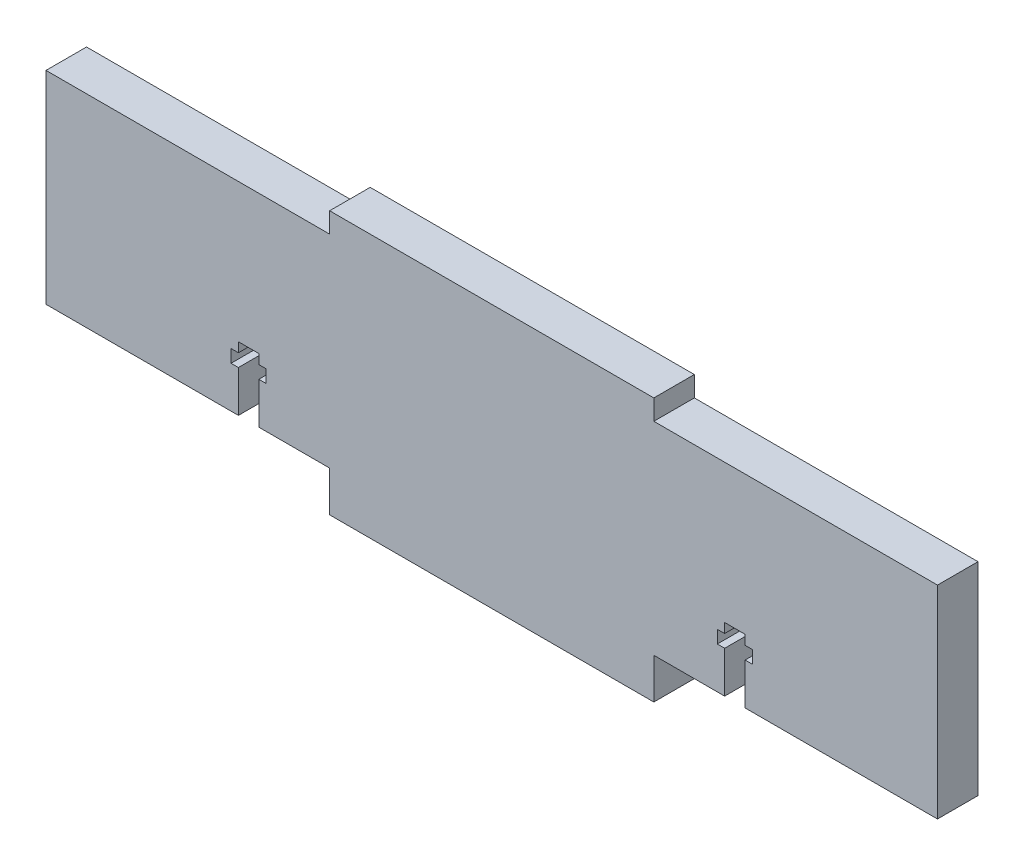
ISO-10303-21;
HEADER;
FILE_DESCRIPTION(('STEP AP214'),'2;1');
FILE_NAME('part.step','',(''),(''),'','','');
FILE_SCHEMA(('AUTOMOTIVE_DESIGN { 1 0 10303 214 1 1 1 1 }'));
ENDSEC;
DATA;
#1=APPLICATION_CONTEXT('core data for automotive mechanical design processes');
#2=APPLICATION_PROTOCOL_DEFINITION('international standard','automotive_design',2000,#1);
#3=PRODUCT_CONTEXT('',#1,'mechanical');
#4=PRODUCT('Part','Part','',(#3));
#5=PRODUCT_RELATED_PRODUCT_CATEGORY('part','',(#4));
#6=PRODUCT_DEFINITION_FORMATION('','',#4);
#7=PRODUCT_DEFINITION_CONTEXT('part definition',#1,'design');
#8=PRODUCT_DEFINITION('design','',#6,#7);
#9=PRODUCT_DEFINITION_SHAPE('','',#8);
#10=(LENGTH_UNIT() NAMED_UNIT(*) SI_UNIT(.MILLI.,.METRE.));
#11=(NAMED_UNIT(*) PLANE_ANGLE_UNIT() SI_UNIT($,.RADIAN.));
#12=(NAMED_UNIT(*) SI_UNIT($,.STERADIAN.) SOLID_ANGLE_UNIT());
#13=UNCERTAINTY_MEASURE_WITH_UNIT(LENGTH_MEASURE(1.E-05),#10,'distance_accuracy_value','');
#14=(GEOMETRIC_REPRESENTATION_CONTEXT(3) GLOBAL_UNCERTAINTY_ASSIGNED_CONTEXT((#13)) GLOBAL_UNIT_ASSIGNED_CONTEXT((#10,
#11,#12)) REPRESENTATION_CONTEXT('',''));
#15=CARTESIAN_POINT('',(0.,0.,0.));
#16=DIRECTION('',(0.,0.,1.));
#17=DIRECTION('',(1.,0.,0.));
#18=AXIS2_PLACEMENT_3D('',#15,#16,#17);
#19=CARTESIAN_POINT('',(95.25,0.,6.35));
#20=DIRECTION('',(0.,1.,0.));
#21=DIRECTION('',(0.,0.,1.));
#22=AXIS2_PLACEMENT_3D('',#19,#20,#21);
#23=PLANE('',#22);
#24=DIRECTION('',(1.,0.,0.));
#25=VECTOR('',#24,1.);
#26=CARTESIAN_POINT('',(95.25,0.,6.35));
#27=LINE('',#26,#25);
#28=CARTESIAN_POINT('',(109.55,0.,6.35));
#29=VERTEX_POINT('',#28);
#30=CARTESIAN_POINT('',(139.7,0.,6.35));
#31=VERTEX_POINT('',#30);
#32=EDGE_CURVE('E466',#29,#31,#27,.T.);
#33=ORIENTED_EDGE('',*,*,#32,.F.);
#34=DIRECTION('',(0.,0.,1.));
#35=VECTOR('',#34,1.);
#36=CARTESIAN_POINT('',(109.55,0.,0.));
#37=LINE('',#36,#35);
#38=CARTESIAN_POINT('',(109.55,0.,0.));
#39=VERTEX_POINT('',#38);
#40=EDGE_CURVE('E348',#39,#29,#37,.T.);
#41=ORIENTED_EDGE('',*,*,#40,.F.);
#42=DIRECTION('',(1.,0.,0.));
#43=VECTOR('',#42,1.);
#44=CARTESIAN_POINT('',(95.25,0.,0.));
#45=LINE('',#44,#43);
#46=CARTESIAN_POINT('',(139.7,0.,0.));
#47=VERTEX_POINT('',#46);
#48=EDGE_CURVE('E495',#39,#47,#45,.T.);
#49=ORIENTED_EDGE('',*,*,#48,.T.);
#50=DIRECTION('',(0.,0.,-1.));
#51=VECTOR('',#50,1.);
#52=CARTESIAN_POINT('',(139.7,0.,6.35));
#53=LINE('',#52,#51);
#54=EDGE_CURVE('E527',#31,#47,#53,.T.);
#55=ORIENTED_EDGE('',*,*,#54,.F.);
#56=EDGE_LOOP('',(#33,#41,#49,#55));
#57=FACE_BOUND('',#56,.T.);
#58=ADVANCED_FACE('F33',(#57),#23,.F.);
#59=CARTESIAN_POINT('',(0.,0.,6.35));
#60=DIRECTION('',(0.,1.,0.));
#61=DIRECTION('',(0.,0.,1.));
#62=AXIS2_PLACEMENT_3D('',#59,#60,#61);
#63=PLANE('',#62);
#64=DIRECTION('',(1.,0.,0.));
#65=VECTOR('',#64,1.);
#66=CARTESIAN_POINT('',(0.,0.,0.));
#67=LINE('',#66,#65);
#68=CARTESIAN_POINT('',(0.,0.,0.));
#69=VERTEX_POINT('',#68);
#70=CARTESIAN_POINT('',(30.15,0.,0.));
#71=VERTEX_POINT('',#70);
#72=EDGE_CURVE('E486',#69,#71,#67,.T.);
#73=ORIENTED_EDGE('',*,*,#72,.T.);
#74=DIRECTION('',(0.,0.,1.));
#75=VECTOR('',#74,1.);
#76=CARTESIAN_POINT('',(30.15,0.,0.));
#77=LINE('',#76,#75);
#78=CARTESIAN_POINT('',(30.15,0.,6.35));
#79=VERTEX_POINT('',#78);
#80=EDGE_CURVE('E396',#71,#79,#77,.T.);
#81=ORIENTED_EDGE('',*,*,#80,.T.);
#82=DIRECTION('',(1.,0.,0.));
#83=VECTOR('',#82,1.);
#84=CARTESIAN_POINT('',(0.,0.,6.35));
#85=LINE('',#84,#83);
#86=CARTESIAN_POINT('',(0.,0.,6.35));
#87=VERTEX_POINT('',#86);
#88=EDGE_CURVE('E457',#87,#79,#85,.T.);
#89=ORIENTED_EDGE('',*,*,#88,.F.);
#90=DIRECTION('',(0.,0.,-1.));
#91=VECTOR('',#90,1.);
#92=CARTESIAN_POINT('',(0.,0.,6.35));
#93=LINE('',#92,#91);
#94=EDGE_CURVE('E11',#87,#69,#93,.T.);
#95=ORIENTED_EDGE('',*,*,#94,.T.);
#96=EDGE_LOOP('',(#73,#81,#89,#95));
#97=FACE_BOUND('',#96,.T.);
#98=ADVANCED_FACE('F608',(#97),#63,.F.);
#99=CARTESIAN_POINT('',(0.,0.,6.35));
#100=DIRECTION('',(1.,0.,0.));
#101=DIRECTION('',(0.,0.,-1.));
#102=AXIS2_PLACEMENT_3D('',#99,#100,#101);
#103=PLANE('',#102);
#104=DIRECTION('',(0.,-1.,0.));
#105=VECTOR('',#104,1.);
#106=CARTESIAN_POINT('',(0.,0.,0.));
#107=LINE('',#106,#105);
#108=CARTESIAN_POINT('',(0.,31.75,0.));
#109=VERTEX_POINT('',#108);
#110=EDGE_CURVE('E429',#109,#69,#107,.T.);
#111=ORIENTED_EDGE('',*,*,#110,.T.);
#112=ORIENTED_EDGE('',*,*,#94,.F.);
#113=DIRECTION('',(0.,-1.,0.));
#114=VECTOR('',#113,1.);
#115=CARTESIAN_POINT('',(0.,0.,6.35));
#116=LINE('',#115,#114);
#117=CARTESIAN_POINT('',(0.,31.75,6.35));
#118=VERTEX_POINT('',#117);
#119=EDGE_CURVE('E452',#118,#87,#116,.T.);
#120=ORIENTED_EDGE('',*,*,#119,.F.);
#121=DIRECTION('',(0.,0.,-1.));
#122=VECTOR('',#121,1.);
#123=CARTESIAN_POINT('',(0.,31.75,6.35));
#124=LINE('',#123,#122);
#125=EDGE_CURVE('E482',#118,#109,#124,.T.);
#126=ORIENTED_EDGE('',*,*,#125,.T.);
#127=EDGE_LOOP('',(#111,#112,#120,#126));
#128=FACE_BOUND('',#127,.T.);
#129=ADVANCED_FACE('F35',(#128),#103,.F.);
#130=CARTESIAN_POINT('',(33.35,0.,6.35));
#131=VERTEX_POINT('',#130);
#132=CARTESIAN_POINT('',(44.45,0.,6.35));
#133=VERTEX_POINT('',#132);
#134=EDGE_CURVE('E455',#131,#133,#85,.T.);
#135=ORIENTED_EDGE('',*,*,#134,.F.);
#136=DIRECTION('',(0.,0.,1.));
#137=VECTOR('',#136,1.);
#138=CARTESIAN_POINT('',(33.35,0.,0.));
#139=LINE('',#138,#137);
#140=CARTESIAN_POINT('',(33.35,0.,0.));
#141=VERTEX_POINT('',#140);
#142=EDGE_CURVE('E448',#141,#131,#139,.T.);
#143=ORIENTED_EDGE('',*,*,#142,.F.);
#144=CARTESIAN_POINT('',(44.45,0.,0.));
#145=VERTEX_POINT('',#144);
#146=EDGE_CURVE('E485',#141,#145,#67,.T.);
#147=ORIENTED_EDGE('',*,*,#146,.T.);
#148=DIRECTION('',(0.,0.,-1.));
#149=VECTOR('',#148,1.);
#150=CARTESIAN_POINT('',(44.45,0.,6.35));
#151=LINE('',#150,#149);
#152=EDGE_CURVE('E41',#133,#145,#151,.T.);
#153=ORIENTED_EDGE('',*,*,#152,.F.);
#154=EDGE_LOOP('',(#135,#143,#147,#153));
#155=FACE_BOUND('',#154,.T.);
#156=ADVANCED_FACE('F567',(#155),#63,.F.);
#157=CARTESIAN_POINT('',(44.45,0.,6.35));
#158=DIRECTION('',(1.,0.,0.));
#159=DIRECTION('',(0.,1.,0.));
#160=AXIS2_PLACEMENT_3D('',#157,#158,#159);
#161=PLANE('',#160);
#162=DIRECTION('',(0.,-1.,0.));
#163=VECTOR('',#162,1.);
#164=CARTESIAN_POINT('',(44.45,0.,0.));
#165=LINE('',#164,#163);
#166=CARTESIAN_POINT('',(44.45,-6.35,0.));
#167=VERTEX_POINT('',#166);
#168=EDGE_CURVE('E489',#145,#167,#165,.T.);
#169=ORIENTED_EDGE('',*,*,#168,.T.);
#170=DIRECTION('',(0.,0.,-1.));
#171=VECTOR('',#170,1.);
#172=CARTESIAN_POINT('',(44.45,-6.35,6.35));
#173=LINE('',#172,#171);
#174=CARTESIAN_POINT('',(44.45,-6.35,6.35));
#175=VERTEX_POINT('',#174);
#176=EDGE_CURVE('E536',#175,#167,#173,.T.);
#177=ORIENTED_EDGE('',*,*,#176,.F.);
#178=DIRECTION('',(0.,-1.,0.));
#179=VECTOR('',#178,1.);
#180=CARTESIAN_POINT('',(44.45,0.,6.35));
#181=LINE('',#180,#179);
#182=EDGE_CURVE('E460',#133,#175,#181,.T.);
#183=ORIENTED_EDGE('',*,*,#182,.F.);
#184=ORIENTED_EDGE('',*,*,#152,.T.);
#185=EDGE_LOOP('',(#169,#177,#183,#184));
#186=FACE_BOUND('',#185,.T.);
#187=ADVANCED_FACE('F543',(#186),#161,.F.);
#188=CARTESIAN_POINT('',(44.45,-6.35,6.35));
#189=DIRECTION('',(0.,1.,0.));
#190=DIRECTION('',(0.,0.,1.));
#191=AXIS2_PLACEMENT_3D('',#188,#189,#190);
#192=PLANE('',#191);
#193=DIRECTION('',(1.,0.,0.));
#194=VECTOR('',#193,1.);
#195=CARTESIAN_POINT('',(44.45,-6.35,0.));
#196=LINE('',#195,#194);
#197=CARTESIAN_POINT('',(95.25,-6.35,0.));
#198=VERTEX_POINT('',#197);
#199=EDGE_CURVE('E491',#167,#198,#196,.T.);
#200=ORIENTED_EDGE('',*,*,#199,.T.);
#201=DIRECTION('',(0.,0.,-1.));
#202=VECTOR('',#201,1.);
#203=CARTESIAN_POINT('',(95.25,-6.35,6.35));
#204=LINE('',#203,#202);
#205=CARTESIAN_POINT('',(95.25,-6.35,6.35));
#206=VERTEX_POINT('',#205);
#207=EDGE_CURVE('E533',#206,#198,#204,.T.);
#208=ORIENTED_EDGE('',*,*,#207,.F.);
#209=DIRECTION('',(1.,0.,0.));
#210=VECTOR('',#209,1.);
#211=CARTESIAN_POINT('',(44.45,-6.35,6.35));
#212=LINE('',#211,#210);
#213=EDGE_CURVE('E462',#175,#206,#212,.T.);
#214=ORIENTED_EDGE('',*,*,#213,.F.);
#215=ORIENTED_EDGE('',*,*,#176,.T.);
#216=EDGE_LOOP('',(#200,#208,#214,#215));
#217=FACE_BOUND('',#216,.T.);
#218=ADVANCED_FACE('F553',(#217),#192,.F.);
#219=CARTESIAN_POINT('',(95.25,0.,6.35));
#220=DIRECTION('',(-1.,0.,0.));
#221=DIRECTION('',(0.,0.,1.));
#222=AXIS2_PLACEMENT_3D('',#219,#220,#221);
#223=PLANE('',#222);
#224=DIRECTION('',(0.,1.,0.));
#225=VECTOR('',#224,1.);
#226=CARTESIAN_POINT('',(95.25,0.,0.));
#227=LINE('',#226,#225);
#228=CARTESIAN_POINT('',(95.25,0.,0.));
#229=VERTEX_POINT('',#228);
#230=EDGE_CURVE('E493',#198,#229,#227,.T.);
#231=ORIENTED_EDGE('',*,*,#230,.T.);
#232=DIRECTION('',(0.,0.,-1.));
#233=VECTOR('',#232,1.);
#234=CARTESIAN_POINT('',(95.25,0.,6.35));
#235=LINE('',#234,#233);
#236=CARTESIAN_POINT('',(95.25,0.,6.35));
#237=VERTEX_POINT('',#236);
#238=EDGE_CURVE('E530',#237,#229,#235,.T.);
#239=ORIENTED_EDGE('',*,*,#238,.F.);
#240=DIRECTION('',(0.,1.,0.));
#241=VECTOR('',#240,1.);
#242=CARTESIAN_POINT('',(95.25,0.,6.35));
#243=LINE('',#242,#241);
#244=EDGE_CURVE('E464',#206,#237,#243,.T.);
#245=ORIENTED_EDGE('',*,*,#244,.F.);
#246=ORIENTED_EDGE('',*,*,#207,.T.);
#247=EDGE_LOOP('',(#231,#239,#245,#246));
#248=FACE_BOUND('',#247,.T.);
#249=ADVANCED_FACE('F557',(#248),#223,.F.);
#250=CARTESIAN_POINT('',(106.35,0.,0.));
#251=VERTEX_POINT('',#250);
#252=EDGE_CURVE('E496',#229,#251,#45,.T.);
#253=ORIENTED_EDGE('',*,*,#252,.T.);
#254=DIRECTION('',(0.,0.,1.));
#255=VECTOR('',#254,1.);
#256=CARTESIAN_POINT('',(106.35,0.,0.));
#257=LINE('',#256,#255);
#258=CARTESIAN_POINT('',(106.35,0.,6.35));
#259=VERTEX_POINT('',#258);
#260=EDGE_CURVE('E350',#251,#259,#257,.T.);
#261=ORIENTED_EDGE('',*,*,#260,.T.);
#262=EDGE_CURVE('E467',#237,#259,#27,.T.);
#263=ORIENTED_EDGE('',*,*,#262,.F.);
#264=ORIENTED_EDGE('',*,*,#238,.T.);
#265=EDGE_LOOP('',(#253,#261,#263,#264));
#266=FACE_BOUND('',#265,.T.);
#267=ADVANCED_FACE('F677',(#266),#23,.F.);
#268=CARTESIAN_POINT('',(139.7,0.,6.35));
#269=DIRECTION('',(-1.,0.,0.));
#270=DIRECTION('',(0.,0.,1.));
#271=AXIS2_PLACEMENT_3D('',#268,#269,#270);
#272=PLANE('',#271);
#273=DIRECTION('',(0.,1.,0.));
#274=VECTOR('',#273,1.);
#275=CARTESIAN_POINT('',(139.7,0.,0.));
#276=LINE('',#275,#274);
#277=CARTESIAN_POINT('',(139.7,31.75,0.));
#278=VERTEX_POINT('',#277);
#279=EDGE_CURVE('E499',#47,#278,#276,.T.);
#280=ORIENTED_EDGE('',*,*,#279,.T.);
#281=DIRECTION('',(0.,0.,-1.));
#282=VECTOR('',#281,1.);
#283=CARTESIAN_POINT('',(139.7,31.75,6.35));
#284=LINE('',#283,#282);
#285=CARTESIAN_POINT('',(139.7,31.75,6.35));
#286=VERTEX_POINT('',#285);
#287=EDGE_CURVE('E524',#286,#278,#284,.T.);
#288=ORIENTED_EDGE('',*,*,#287,.F.);
#289=DIRECTION('',(0.,1.,0.));
#290=VECTOR('',#289,1.);
#291=CARTESIAN_POINT('',(139.7,0.,6.35));
#292=LINE('',#291,#290);
#293=EDGE_CURVE('E470',#31,#286,#292,.T.);
#294=ORIENTED_EDGE('',*,*,#293,.F.);
#295=ORIENTED_EDGE('',*,*,#54,.T.);
#296=EDGE_LOOP('',(#280,#288,#294,#295));
#297=FACE_BOUND('',#296,.T.);
#298=ADVANCED_FACE('F641',(#297),#272,.F.);
#299=CARTESIAN_POINT('',(95.25,31.75,6.35));
#300=DIRECTION('',(0.,-1.,0.));
#301=DIRECTION('',(0.,0.,-1.));
#302=AXIS2_PLACEMENT_3D('',#299,#300,#301);
#303=PLANE('',#302);
#304=DIRECTION('',(-1.,0.,0.));
#305=VECTOR('',#304,1.);
#306=CARTESIAN_POINT('',(95.25,31.75,0.));
#307=LINE('',#306,#305);
#308=CARTESIAN_POINT('',(95.25,31.75,0.));
#309=VERTEX_POINT('',#308);
#310=EDGE_CURVE('E501',#278,#309,#307,.T.);
#311=ORIENTED_EDGE('',*,*,#310,.T.);
#312=DIRECTION('',(0.,0.,-1.));
#313=VECTOR('',#312,1.);
#314=CARTESIAN_POINT('',(95.25,31.75,6.35));
#315=LINE('',#314,#313);
#316=CARTESIAN_POINT('',(95.25,31.75,6.35));
#317=VERTEX_POINT('',#316);
#318=EDGE_CURVE('E521',#317,#309,#315,.T.);
#319=ORIENTED_EDGE('',*,*,#318,.F.);
#320=DIRECTION('',(-1.,0.,0.));
#321=VECTOR('',#320,1.);
#322=CARTESIAN_POINT('',(95.25,31.75,6.35));
#323=LINE('',#322,#321);
#324=EDGE_CURVE('E472',#286,#317,#323,.T.);
#325=ORIENTED_EDGE('',*,*,#324,.F.);
#326=ORIENTED_EDGE('',*,*,#287,.T.);
#327=EDGE_LOOP('',(#311,#319,#325,#326));
#328=FACE_BOUND('',#327,.T.);
#329=ADVANCED_FACE('F637',(#328),#303,.F.);
#330=CARTESIAN_POINT('',(95.25,31.75,6.35));
#331=DIRECTION('',(-1.,0.,0.));
#332=DIRECTION('',(0.,0.,1.));
#333=AXIS2_PLACEMENT_3D('',#330,#331,#332);
#334=PLANE('',#333);
#335=DIRECTION('',(0.,1.,0.));
#336=VECTOR('',#335,1.);
#337=CARTESIAN_POINT('',(95.25,31.75,0.));
#338=LINE('',#337,#336);
#339=CARTESIAN_POINT('',(95.25,34.925,0.));
#340=VERTEX_POINT('',#339);
#341=EDGE_CURVE('E503',#309,#340,#338,.T.);
#342=ORIENTED_EDGE('',*,*,#341,.T.);
#343=DIRECTION('',(0.,0.,-1.));
#344=VECTOR('',#343,1.);
#345=CARTESIAN_POINT('',(95.25,34.925,6.35));
#346=LINE('',#345,#344);
#347=CARTESIAN_POINT('',(95.25,34.925,6.35));
#348=VERTEX_POINT('',#347);
#349=EDGE_CURVE('E518',#348,#340,#346,.T.);
#350=ORIENTED_EDGE('',*,*,#349,.F.);
#351=DIRECTION('',(0.,1.,0.));
#352=VECTOR('',#351,1.);
#353=CARTESIAN_POINT('',(95.25,31.75,6.35));
#354=LINE('',#353,#352);
#355=EDGE_CURVE('E474',#317,#348,#354,.T.);
#356=ORIENTED_EDGE('',*,*,#355,.F.);
#357=ORIENTED_EDGE('',*,*,#318,.T.);
#358=EDGE_LOOP('',(#342,#350,#356,#357));
#359=FACE_BOUND('',#358,.T.);
#360=ADVANCED_FACE('F632',(#359),#334,.F.);
#361=CARTESIAN_POINT('',(44.45,34.925,6.35));
#362=DIRECTION('',(0.,-1.,0.));
#363=DIRECTION('',(0.,0.,-1.));
#364=AXIS2_PLACEMENT_3D('',#361,#362,#363);
#365=PLANE('',#364);
#366=DIRECTION('',(-1.,0.,0.));
#367=VECTOR('',#366,1.);
#368=CARTESIAN_POINT('',(44.45,34.925,0.));
#369=LINE('',#368,#367);
#370=CARTESIAN_POINT('',(44.45,34.925,0.));
#371=VERTEX_POINT('',#370);
#372=EDGE_CURVE('E505',#340,#371,#369,.T.);
#373=ORIENTED_EDGE('',*,*,#372,.T.);
#374=DIRECTION('',(0.,0.,-1.));
#375=VECTOR('',#374,1.);
#376=CARTESIAN_POINT('',(44.45,34.925,6.35));
#377=LINE('',#376,#375);
#378=CARTESIAN_POINT('',(44.45,34.925,6.35));
#379=VERTEX_POINT('',#378);
#380=EDGE_CURVE('E515',#379,#371,#377,.T.);
#381=ORIENTED_EDGE('',*,*,#380,.F.);
#382=DIRECTION('',(-1.,0.,0.));
#383=VECTOR('',#382,1.);
#384=CARTESIAN_POINT('',(44.45,34.925,6.35));
#385=LINE('',#384,#383);
#386=EDGE_CURVE('E476',#348,#379,#385,.T.);
#387=ORIENTED_EDGE('',*,*,#386,.F.);
#388=ORIENTED_EDGE('',*,*,#349,.T.);
#389=EDGE_LOOP('',(#373,#381,#387,#388));
#390=FACE_BOUND('',#389,.T.);
#391=ADVANCED_FACE('F626',(#390),#365,.F.);
#392=CARTESIAN_POINT('',(44.45,31.75,6.35));
#393=DIRECTION('',(1.,0.,0.));
#394=DIRECTION('',(0.,0.,-1.));
#395=AXIS2_PLACEMENT_3D('',#392,#393,#394);
#396=PLANE('',#395);
#397=DIRECTION('',(0.,-1.,0.));
#398=VECTOR('',#397,1.);
#399=CARTESIAN_POINT('',(44.45,31.75,0.));
#400=LINE('',#399,#398);
#401=CARTESIAN_POINT('',(44.45,31.75,0.));
#402=VERTEX_POINT('',#401);
#403=EDGE_CURVE('E507',#371,#402,#400,.T.);
#404=ORIENTED_EDGE('',*,*,#403,.T.);
#405=DIRECTION('',(0.,0.,-1.));
#406=VECTOR('',#405,1.);
#407=CARTESIAN_POINT('',(44.45,31.75,6.35));
#408=LINE('',#407,#406);
#409=CARTESIAN_POINT('',(44.45,31.75,6.35));
#410=VERTEX_POINT('',#409);
#411=EDGE_CURVE('E512',#410,#402,#408,.T.);
#412=ORIENTED_EDGE('',*,*,#411,.F.);
#413=DIRECTION('',(0.,-1.,0.));
#414=VECTOR('',#413,1.);
#415=CARTESIAN_POINT('',(44.45,31.75,6.35));
#416=LINE('',#415,#414);
#417=EDGE_CURVE('E478',#379,#410,#416,.T.);
#418=ORIENTED_EDGE('',*,*,#417,.F.);
#419=ORIENTED_EDGE('',*,*,#380,.T.);
#420=EDGE_LOOP('',(#404,#412,#418,#419));
#421=FACE_BOUND('',#420,.T.);
#422=ADVANCED_FACE('F622',(#421),#396,.F.);
#423=CARTESIAN_POINT('',(0.,31.75,6.35));
#424=DIRECTION('',(0.,-1.,0.));
#425=DIRECTION('',(0.,0.,-1.));
#426=AXIS2_PLACEMENT_3D('',#423,#424,#425);
#427=PLANE('',#426);
#428=DIRECTION('',(-1.,0.,0.));
#429=VECTOR('',#428,1.);
#430=CARTESIAN_POINT('',(0.,31.75,0.));
#431=LINE('',#430,#429);
#432=EDGE_CURVE('E456',#402,#109,#431,.T.);
#433=ORIENTED_EDGE('',*,*,#432,.T.);
#434=ORIENTED_EDGE('',*,*,#125,.F.);
#435=DIRECTION('',(-1.,0.,0.));
#436=VECTOR('',#435,1.);
#437=CARTESIAN_POINT('',(0.,31.75,6.35));
#438=LINE('',#437,#436);
#439=EDGE_CURVE('E480',#410,#118,#438,.T.);
#440=ORIENTED_EDGE('',*,*,#439,.F.);
#441=ORIENTED_EDGE('',*,*,#411,.T.);
#442=EDGE_LOOP('',(#433,#434,#440,#441));
#443=FACE_BOUND('',#442,.T.);
#444=ADVANCED_FACE('F617',(#443),#427,.F.);
#445=CARTESIAN_POINT('',(0.,0.,6.35));
#446=DIRECTION('',(0.,0.,-1.));
#447=DIRECTION('',(-1.,0.,0.));
#448=AXIS2_PLACEMENT_3D('',#445,#446,#447);
#449=PLANE('',#448);
#450=DIRECTION('',(1.,0.,0.));
#451=VECTOR('',#450,1.);
#452=CARTESIAN_POINT('',(109.55,6.5,6.35));
#453=LINE('',#452,#451);
#454=CARTESIAN_POINT('',(109.55,6.5,6.35));
#455=VERTEX_POINT('',#454);
#456=CARTESIAN_POINT('',(110.7,6.5,6.35));
#457=VERTEX_POINT('',#456);
#458=EDGE_CURVE('E292',#455,#457,#453,.T.);
#459=ORIENTED_EDGE('',*,*,#458,.F.);
#460=DIRECTION('',(0.,1.,0.));
#461=VECTOR('',#460,1.);
#462=CARTESIAN_POINT('',(109.55,0.,6.35));
#463=LINE('',#462,#461);
#464=EDGE_CURVE('E336',#29,#455,#463,.T.);
#465=ORIENTED_EDGE('',*,*,#464,.F.);
#466=ORIENTED_EDGE('',*,*,#32,.T.);
#467=ORIENTED_EDGE('',*,*,#293,.T.);
#468=ORIENTED_EDGE('',*,*,#324,.T.);
#469=ORIENTED_EDGE('',*,*,#355,.T.);
#470=ORIENTED_EDGE('',*,*,#386,.T.);
#471=ORIENTED_EDGE('',*,*,#417,.T.);
#472=ORIENTED_EDGE('',*,*,#439,.T.);
#473=ORIENTED_EDGE('',*,*,#119,.T.);
#474=ORIENTED_EDGE('',*,*,#88,.T.);
#475=DIRECTION('',(0.,-1.,0.));
#476=VECTOR('',#475,1.);
#477=CARTESIAN_POINT('',(30.15,0.,6.35));
#478=LINE('',#477,#476);
#479=CARTESIAN_POINT('',(30.15,6.5,6.35));
#480=VERTEX_POINT('',#479);
#481=EDGE_CURVE('E343',#480,#79,#478,.T.);
#482=ORIENTED_EDGE('',*,*,#481,.F.);
#483=DIRECTION('',(1.,0.,0.));
#484=VECTOR('',#483,1.);
#485=CARTESIAN_POINT('',(30.15,6.5,6.35));
#486=LINE('',#485,#484);
#487=CARTESIAN_POINT('',(29.,6.5,6.35));
#488=VERTEX_POINT('',#487);
#489=EDGE_CURVE('E368',#488,#480,#486,.T.);
#490=ORIENTED_EDGE('',*,*,#489,.F.);
#491=DIRECTION('',(0.,-1.,0.));
#492=VECTOR('',#491,1.);
#493=CARTESIAN_POINT('',(29.,8.5,6.35));
#494=LINE('',#493,#492);
#495=CARTESIAN_POINT('',(29.,8.5,6.35));
#496=VERTEX_POINT('',#495);
#497=EDGE_CURVE('E422',#496,#488,#494,.T.);
#498=ORIENTED_EDGE('',*,*,#497,.F.);
#499=DIRECTION('',(-1.,0.,0.));
#500=VECTOR('',#499,1.);
#501=CARTESIAN_POINT('',(30.15,8.5,6.35));
#502=LINE('',#501,#500);
#503=CARTESIAN_POINT('',(30.15,8.5,6.35));
#504=VERTEX_POINT('',#503);
#505=EDGE_CURVE('E419',#504,#496,#502,.T.);
#506=ORIENTED_EDGE('',*,*,#505,.F.);
#507=DIRECTION('',(0.,-1.,0.));
#508=VECTOR('',#507,1.);
#509=CARTESIAN_POINT('',(30.15,8.5,6.35));
#510=LINE('',#509,#508);
#511=CARTESIAN_POINT('',(30.15,10.,6.35));
#512=VERTEX_POINT('',#511);
#513=EDGE_CURVE('E416',#512,#504,#510,.T.);
#514=ORIENTED_EDGE('',*,*,#513,.F.);
#515=DIRECTION('',(-1.,0.,0.));
#516=VECTOR('',#515,1.);
#517=CARTESIAN_POINT('',(30.15,10.,6.35));
#518=LINE('',#517,#516);
#519=CARTESIAN_POINT('',(33.35,10.,6.35));
#520=VERTEX_POINT('',#519);
#521=EDGE_CURVE('E413',#520,#512,#518,.T.);
#522=ORIENTED_EDGE('',*,*,#521,.F.);
#523=DIRECTION('',(0.,1.,0.));
#524=VECTOR('',#523,1.);
#525=CARTESIAN_POINT('',(33.35,8.5,6.35));
#526=LINE('',#525,#524);
#527=CARTESIAN_POINT('',(33.35,8.5,6.35));
#528=VERTEX_POINT('',#527);
#529=EDGE_CURVE('E410',#528,#520,#526,.T.);
#530=ORIENTED_EDGE('',*,*,#529,.F.);
#531=DIRECTION('',(-1.,0.,0.));
#532=VECTOR('',#531,1.);
#533=CARTESIAN_POINT('',(33.35,8.5,6.35));
#534=LINE('',#533,#532);
#535=CARTESIAN_POINT('',(34.5,8.5,6.35));
#536=VERTEX_POINT('',#535);
#537=EDGE_CURVE('E407',#536,#528,#534,.T.);
#538=ORIENTED_EDGE('',*,*,#537,.F.);
#539=DIRECTION('',(0.,1.,0.));
#540=VECTOR('',#539,1.);
#541=CARTESIAN_POINT('',(34.5,8.5,6.35));
#542=LINE('',#541,#540);
#543=CARTESIAN_POINT('',(34.5,6.5,6.35));
#544=VERTEX_POINT('',#543);
#545=EDGE_CURVE('E404',#544,#536,#542,.T.);
#546=ORIENTED_EDGE('',*,*,#545,.F.);
#547=DIRECTION('',(1.,0.,0.));
#548=VECTOR('',#547,1.);
#549=CARTESIAN_POINT('',(33.35,6.5,6.35));
#550=LINE('',#549,#548);
#551=CARTESIAN_POINT('',(33.35,6.5,6.35));
#552=VERTEX_POINT('',#551);
#553=EDGE_CURVE('E401',#552,#544,#550,.T.);
#554=ORIENTED_EDGE('',*,*,#553,.F.);
#555=DIRECTION('',(0.,1.,0.));
#556=VECTOR('',#555,1.);
#557=CARTESIAN_POINT('',(33.35,0.,6.35));
#558=LINE('',#557,#556);
#559=EDGE_CURVE('E398',#131,#552,#558,.T.);
#560=ORIENTED_EDGE('',*,*,#559,.F.);
#561=ORIENTED_EDGE('',*,*,#134,.T.);
#562=ORIENTED_EDGE('',*,*,#182,.T.);
#563=ORIENTED_EDGE('',*,*,#213,.T.);
#564=ORIENTED_EDGE('',*,*,#244,.T.);
#565=ORIENTED_EDGE('',*,*,#262,.T.);
#566=DIRECTION('',(0.,-1.,0.));
#567=VECTOR('',#566,1.);
#568=CARTESIAN_POINT('',(106.35,0.,6.35));
#569=LINE('',#568,#567);
#570=CARTESIAN_POINT('',(106.35,6.5,6.35));
#571=VERTEX_POINT('',#570);
#572=EDGE_CURVE('E334',#571,#259,#569,.T.);
#573=ORIENTED_EDGE('',*,*,#572,.F.);
#574=DIRECTION('',(1.,0.,0.));
#575=VECTOR('',#574,1.);
#576=CARTESIAN_POINT('',(106.35,6.5,6.35));
#577=LINE('',#576,#575);
#578=CARTESIAN_POINT('',(105.2,6.5,6.35));
#579=VERTEX_POINT('',#578);
#580=EDGE_CURVE('E331',#579,#571,#577,.T.);
#581=ORIENTED_EDGE('',*,*,#580,.F.);
#582=DIRECTION('',(0.,-1.,0.));
#583=VECTOR('',#582,1.);
#584=CARTESIAN_POINT('',(105.2,8.5,6.35));
#585=LINE('',#584,#583);
#586=CARTESIAN_POINT('',(105.2,8.5,6.35));
#587=VERTEX_POINT('',#586);
#588=EDGE_CURVE('E328',#587,#579,#585,.T.);
#589=ORIENTED_EDGE('',*,*,#588,.F.);
#590=DIRECTION('',(-1.,0.,0.));
#591=VECTOR('',#590,1.);
#592=CARTESIAN_POINT('',(106.35,8.5,6.35));
#593=LINE('',#592,#591);
#594=CARTESIAN_POINT('',(106.35,8.5,6.35));
#595=VERTEX_POINT('',#594);
#596=EDGE_CURVE('E325',#595,#587,#593,.T.);
#597=ORIENTED_EDGE('',*,*,#596,.F.);
#598=DIRECTION('',(0.,-1.,0.));
#599=VECTOR('',#598,1.);
#600=CARTESIAN_POINT('',(106.35,8.5,6.35));
#601=LINE('',#600,#599);
#602=CARTESIAN_POINT('',(106.35,10.,6.35));
#603=VERTEX_POINT('',#602);
#604=EDGE_CURVE('E322',#603,#595,#601,.T.);
#605=ORIENTED_EDGE('',*,*,#604,.F.);
#606=DIRECTION('',(-1.,0.,0.));
#607=VECTOR('',#606,1.);
#608=CARTESIAN_POINT('',(109.55,10.,6.35));
#609=LINE('',#608,#607);
#610=CARTESIAN_POINT('',(109.55,10.,6.35));
#611=VERTEX_POINT('',#610);
#612=EDGE_CURVE('E319',#611,#603,#609,.T.);
#613=ORIENTED_EDGE('',*,*,#612,.F.);
#614=DIRECTION('',(0.,1.,0.));
#615=VECTOR('',#614,1.);
#616=CARTESIAN_POINT('',(109.55,8.5,6.35));
#617=LINE('',#616,#615);
#618=CARTESIAN_POINT('',(109.55,8.5,6.35));
#619=VERTEX_POINT('',#618);
#620=EDGE_CURVE('E317',#619,#611,#617,.T.);
#621=ORIENTED_EDGE('',*,*,#620,.F.);
#622=DIRECTION('',(-1.,0.,0.));
#623=VECTOR('',#622,1.);
#624=CARTESIAN_POINT('',(109.55,8.5,6.35));
#625=LINE('',#624,#623);
#626=CARTESIAN_POINT('',(110.7,8.5,6.35));
#627=VERTEX_POINT('',#626);
#628=EDGE_CURVE('E273',#627,#619,#625,.T.);
#629=ORIENTED_EDGE('',*,*,#628,.F.);
#630=DIRECTION('',(0.,1.,0.));
#631=VECTOR('',#630,1.);
#632=CARTESIAN_POINT('',(110.7,8.5,6.35));
#633=LINE('',#632,#631);
#634=EDGE_CURVE('E289',#457,#627,#633,.T.);
#635=ORIENTED_EDGE('',*,*,#634,.F.);
#636=EDGE_LOOP('',(#459,#465,#466,#467,#468,#469,#470,#471,#472,#473,#474,#482,#490,#498,#506,
#514,#522,#530,#538,#546,#554,#560,#561,#562,#563,#564,#565,#573,#581,#589,#597,#605,#613,#621,
#629,#635));
#637=FACE_BOUND('',#636,.T.);
#638=ADVANCED_FACE('F562',(#637),#449,.F.);
#639=CARTESIAN_POINT('',(0.,0.,0.));
#640=DIRECTION('',(0.,0.,-1.));
#641=DIRECTION('',(-1.,0.,0.));
#642=AXIS2_PLACEMENT_3D('',#639,#640,#641);
#643=PLANE('',#642);
#644=DIRECTION('',(0.,1.,0.));
#645=VECTOR('',#644,1.);
#646=CARTESIAN_POINT('',(109.55,0.,0.));
#647=LINE('',#646,#645);
#648=CARTESIAN_POINT('',(109.55,6.5,0.));
#649=VERTEX_POINT('',#648);
#650=EDGE_CURVE('E311',#39,#649,#647,.T.);
#651=ORIENTED_EDGE('',*,*,#650,.T.);
#652=DIRECTION('',(1.,0.,0.));
#653=VECTOR('',#652,1.);
#654=CARTESIAN_POINT('',(109.55,6.5,0.));
#655=LINE('',#654,#653);
#656=CARTESIAN_POINT('',(110.7,6.5,0.));
#657=VERTEX_POINT('',#656);
#658=EDGE_CURVE('E313',#649,#657,#655,.T.);
#659=ORIENTED_EDGE('',*,*,#658,.T.);
#660=DIRECTION('',(0.,1.,0.));
#661=VECTOR('',#660,1.);
#662=CARTESIAN_POINT('',(110.7,8.5,0.));
#663=LINE('',#662,#661);
#664=CARTESIAN_POINT('',(110.7,8.5,0.));
#665=VERTEX_POINT('',#664);
#666=EDGE_CURVE('E278',#657,#665,#663,.T.);
#667=ORIENTED_EDGE('',*,*,#666,.T.);
#668=DIRECTION('',(-1.,0.,0.));
#669=VECTOR('',#668,1.);
#670=CARTESIAN_POINT('',(109.55,8.5,0.));
#671=LINE('',#670,#669);
#672=CARTESIAN_POINT('',(109.55,8.5,0.));
#673=VERTEX_POINT('',#672);
#674=EDGE_CURVE('E270',#665,#673,#671,.T.);
#675=ORIENTED_EDGE('',*,*,#674,.T.);
#676=DIRECTION('',(0.,1.,0.));
#677=VECTOR('',#676,1.);
#678=CARTESIAN_POINT('',(109.55,8.5,0.));
#679=LINE('',#678,#677);
#680=CARTESIAN_POINT('',(109.55,10.,0.));
#681=VERTEX_POINT('',#680);
#682=EDGE_CURVE('E281',#673,#681,#679,.T.);
#683=ORIENTED_EDGE('',*,*,#682,.T.);
#684=DIRECTION('',(-1.,0.,0.));
#685=VECTOR('',#684,1.);
#686=CARTESIAN_POINT('',(109.55,10.,0.));
#687=LINE('',#686,#685);
#688=CARTESIAN_POINT('',(106.35,10.,0.));
#689=VERTEX_POINT('',#688);
#690=EDGE_CURVE('E48',#681,#689,#687,.T.);
#691=ORIENTED_EDGE('',*,*,#690,.T.);
#692=DIRECTION('',(0.,-1.,0.));
#693=VECTOR('',#692,1.);
#694=CARTESIAN_POINT('',(106.35,8.5,0.));
#695=LINE('',#694,#693);
#696=CARTESIAN_POINT('',(106.35,8.5,0.));
#697=VERTEX_POINT('',#696);
#698=EDGE_CURVE('E296',#689,#697,#695,.T.);
#699=ORIENTED_EDGE('',*,*,#698,.T.);
#700=DIRECTION('',(-1.,0.,0.));
#701=VECTOR('',#700,1.);
#702=CARTESIAN_POINT('',(106.35,8.5,0.));
#703=LINE('',#702,#701);
#704=CARTESIAN_POINT('',(105.2,8.5,0.));
#705=VERTEX_POINT('',#704);
#706=EDGE_CURVE('E299',#697,#705,#703,.T.);
#707=ORIENTED_EDGE('',*,*,#706,.T.);
#708=DIRECTION('',(0.,-1.,0.));
#709=VECTOR('',#708,1.);
#710=CARTESIAN_POINT('',(105.2,8.5,0.));
#711=LINE('',#710,#709);
#712=CARTESIAN_POINT('',(105.2,6.5,0.));
#713=VERTEX_POINT('',#712);
#714=EDGE_CURVE('E302',#705,#713,#711,.T.);
#715=ORIENTED_EDGE('',*,*,#714,.T.);
#716=DIRECTION('',(1.,0.,0.));
#717=VECTOR('',#716,1.);
#718=CARTESIAN_POINT('',(106.35,6.5,0.));
#719=LINE('',#718,#717);
#720=CARTESIAN_POINT('',(106.35,6.5,0.));
#721=VERTEX_POINT('',#720);
#722=EDGE_CURVE('E305',#713,#721,#719,.T.);
#723=ORIENTED_EDGE('',*,*,#722,.T.);
#724=DIRECTION('',(0.,-1.,0.));
#725=VECTOR('',#724,1.);
#726=CARTESIAN_POINT('',(106.35,0.,0.));
#727=LINE('',#726,#725);
#728=EDGE_CURVE('E308',#721,#251,#727,.T.);
#729=ORIENTED_EDGE('',*,*,#728,.T.);
#730=ORIENTED_EDGE('',*,*,#252,.F.);
#731=ORIENTED_EDGE('',*,*,#230,.F.);
#732=ORIENTED_EDGE('',*,*,#199,.F.);
#733=ORIENTED_EDGE('',*,*,#168,.F.);
#734=ORIENTED_EDGE('',*,*,#146,.F.);
#735=DIRECTION('',(0.,1.,0.));
#736=VECTOR('',#735,1.);
#737=CARTESIAN_POINT('',(33.35,0.,0.));
#738=LINE('',#737,#736);
#739=CARTESIAN_POINT('',(33.35,6.5,0.));
#740=VERTEX_POINT('',#739);
#741=EDGE_CURVE('E367',#141,#740,#738,.T.);
#742=ORIENTED_EDGE('',*,*,#741,.T.);
#743=DIRECTION('',(1.,0.,0.));
#744=VECTOR('',#743,1.);
#745=CARTESIAN_POINT('',(33.35,6.5,0.));
#746=LINE('',#745,#744);
#747=CARTESIAN_POINT('',(34.5,6.5,0.));
#748=VERTEX_POINT('',#747);
#749=EDGE_CURVE('E56',#740,#748,#746,.T.);
#750=ORIENTED_EDGE('',*,*,#749,.T.);
#751=DIRECTION('',(0.,1.,0.));
#752=VECTOR('',#751,1.);
#753=CARTESIAN_POINT('',(34.5,8.5,0.));
#754=LINE('',#753,#752);
#755=CARTESIAN_POINT('',(34.5,8.5,0.));
#756=VERTEX_POINT('',#755);
#757=EDGE_CURVE('E372',#748,#756,#754,.T.);
#758=ORIENTED_EDGE('',*,*,#757,.T.);
#759=DIRECTION('',(-1.,0.,0.));
#760=VECTOR('',#759,1.);
#761=CARTESIAN_POINT('',(33.35,8.5,0.));
#762=LINE('',#761,#760);
#763=CARTESIAN_POINT('',(33.35,8.5,0.));
#764=VERTEX_POINT('',#763);
#765=EDGE_CURVE('E375',#756,#764,#762,.T.);
#766=ORIENTED_EDGE('',*,*,#765,.T.);
#767=DIRECTION('',(0.,1.,0.));
#768=VECTOR('',#767,1.);
#769=CARTESIAN_POINT('',(33.35,8.5,0.));
#770=LINE('',#769,#768);
#771=CARTESIAN_POINT('',(33.35,10.,0.));
#772=VERTEX_POINT('',#771);
#773=EDGE_CURVE('E378',#764,#772,#770,.T.);
#774=ORIENTED_EDGE('',*,*,#773,.T.);
#775=DIRECTION('',(-1.,0.,0.));
#776=VECTOR('',#775,1.);
#777=CARTESIAN_POINT('',(30.15,10.,0.));
#778=LINE('',#777,#776);
#779=CARTESIAN_POINT('',(30.15,10.,0.));
#780=VERTEX_POINT('',#779);
#781=EDGE_CURVE('E381',#772,#780,#778,.T.);
#782=ORIENTED_EDGE('',*,*,#781,.T.);
#783=DIRECTION('',(0.,-1.,0.));
#784=VECTOR('',#783,1.);
#785=CARTESIAN_POINT('',(30.15,8.5,0.));
#786=LINE('',#785,#784);
#787=CARTESIAN_POINT('',(30.15,8.5,0.));
#788=VERTEX_POINT('',#787);
#789=EDGE_CURVE('E384',#780,#788,#786,.T.);
#790=ORIENTED_EDGE('',*,*,#789,.T.);
#791=DIRECTION('',(-1.,0.,0.));
#792=VECTOR('',#791,1.);
#793=CARTESIAN_POINT('',(30.15,8.5,0.));
#794=LINE('',#793,#792);
#795=CARTESIAN_POINT('',(29.,8.5,0.));
#796=VERTEX_POINT('',#795);
#797=EDGE_CURVE('E387',#788,#796,#794,.T.);
#798=ORIENTED_EDGE('',*,*,#797,.T.);
#799=DIRECTION('',(0.,-1.,0.));
#800=VECTOR('',#799,1.);
#801=CARTESIAN_POINT('',(29.,8.5,0.));
#802=LINE('',#801,#800);
#803=CARTESIAN_POINT('',(29.,6.5,0.));
#804=VERTEX_POINT('',#803);
#805=EDGE_CURVE('E390',#796,#804,#802,.T.);
#806=ORIENTED_EDGE('',*,*,#805,.T.);
#807=DIRECTION('',(1.,0.,0.));
#808=VECTOR('',#807,1.);
#809=CARTESIAN_POINT('',(30.15,6.5,0.));
#810=LINE('',#809,#808);
#811=CARTESIAN_POINT('',(30.15,6.5,0.));
#812=VERTEX_POINT('',#811);
#813=EDGE_CURVE('E393',#804,#812,#810,.T.);
#814=ORIENTED_EDGE('',*,*,#813,.T.);
#815=DIRECTION('',(0.,-1.,0.));
#816=VECTOR('',#815,1.);
#817=CARTESIAN_POINT('',(30.15,0.,0.));
#818=LINE('',#817,#816);
#819=EDGE_CURVE('E364',#812,#71,#818,.T.);
#820=ORIENTED_EDGE('',*,*,#819,.T.);
#821=ORIENTED_EDGE('',*,*,#72,.F.);
#822=ORIENTED_EDGE('',*,*,#110,.F.);
#823=ORIENTED_EDGE('',*,*,#432,.F.);
#824=ORIENTED_EDGE('',*,*,#403,.F.);
#825=ORIENTED_EDGE('',*,*,#372,.F.);
#826=ORIENTED_EDGE('',*,*,#341,.F.);
#827=ORIENTED_EDGE('',*,*,#310,.F.);
#828=ORIENTED_EDGE('',*,*,#279,.F.);
#829=ORIENTED_EDGE('',*,*,#48,.F.);
#830=EDGE_LOOP('',(#651,#659,#667,#675,#683,#691,#699,#707,#715,#723,#729,#730,#731,#732,#733,
#734,#742,#750,#758,#766,#774,#782,#790,#798,#806,#814,#820,#821,#822,#823,#824,#825,#826,#827,
#828,#829));
#831=FACE_BOUND('',#830,.T.);
#832=ADVANCED_FACE('F286',(#831),#643,.T.);
#833=CARTESIAN_POINT('',(30.15,0.,0.));
#834=DIRECTION('',(-1.,0.,0.));
#835=DIRECTION('',(0.,0.,1.));
#836=AXIS2_PLACEMENT_3D('',#833,#834,#835);
#837=PLANE('',#836);
#838=ORIENTED_EDGE('',*,*,#481,.T.);
#839=ORIENTED_EDGE('',*,*,#80,.F.);
#840=ORIENTED_EDGE('',*,*,#819,.F.);
#841=DIRECTION('',(0.,0.,1.));
#842=VECTOR('',#841,1.);
#843=CARTESIAN_POINT('',(30.15,6.5,0.));
#844=LINE('',#843,#842);
#845=EDGE_CURVE('E427',#812,#480,#844,.T.);
#846=ORIENTED_EDGE('',*,*,#845,.T.);
#847=EDGE_LOOP('',(#838,#839,#840,#846));
#848=FACE_BOUND('',#847,.T.);
#849=ADVANCED_FACE('F605',(#848),#837,.F.);
#850=CARTESIAN_POINT('',(30.15,6.5,0.));
#851=DIRECTION('',(0.,-1.,0.));
#852=DIRECTION('',(1.,0.,0.));
#853=AXIS2_PLACEMENT_3D('',#850,#851,#852);
#854=PLANE('',#853);
#855=ORIENTED_EDGE('',*,*,#489,.T.);
#856=ORIENTED_EDGE('',*,*,#845,.F.);
#857=ORIENTED_EDGE('',*,*,#813,.F.);
#858=DIRECTION('',(0.,0.,1.));
#859=VECTOR('',#858,1.);
#860=CARTESIAN_POINT('',(29.,6.5,0.));
#861=LINE('',#860,#859);
#862=EDGE_CURVE('E430',#804,#488,#861,.T.);
#863=ORIENTED_EDGE('',*,*,#862,.T.);
#864=EDGE_LOOP('',(#855,#856,#857,#863));
#865=FACE_BOUND('',#864,.T.);
#866=ADVANCED_FACE('F601',(#865),#854,.F.);
#867=CARTESIAN_POINT('',(29.,8.5,0.));
#868=DIRECTION('',(-1.,0.,0.));
#869=DIRECTION('',(0.,0.,1.));
#870=AXIS2_PLACEMENT_3D('',#867,#868,#869);
#871=PLANE('',#870);
#872=ORIENTED_EDGE('',*,*,#497,.T.);
#873=ORIENTED_EDGE('',*,*,#862,.F.);
#874=ORIENTED_EDGE('',*,*,#805,.F.);
#875=DIRECTION('',(0.,0.,1.));
#876=VECTOR('',#875,1.);
#877=CARTESIAN_POINT('',(29.,8.5,0.));
#878=LINE('',#877,#876);
#879=EDGE_CURVE('E432',#796,#496,#878,.T.);
#880=ORIENTED_EDGE('',*,*,#879,.T.);
#881=EDGE_LOOP('',(#872,#873,#874,#880));
#882=FACE_BOUND('',#881,.T.);
#883=ADVANCED_FACE('F597',(#882),#871,.F.);
#884=CARTESIAN_POINT('',(30.15,8.5,0.));
#885=DIRECTION('',(0.,1.,0.));
#886=DIRECTION('',(0.,0.,1.));
#887=AXIS2_PLACEMENT_3D('',#884,#885,#886);
#888=PLANE('',#887);
#889=ORIENTED_EDGE('',*,*,#505,.T.);
#890=ORIENTED_EDGE('',*,*,#879,.F.);
#891=ORIENTED_EDGE('',*,*,#797,.F.);
#892=DIRECTION('',(0.,0.,1.));
#893=VECTOR('',#892,1.);
#894=CARTESIAN_POINT('',(30.15,8.5,0.));
#895=LINE('',#894,#893);
#896=EDGE_CURVE('E434',#788,#504,#895,.T.);
#897=ORIENTED_EDGE('',*,*,#896,.T.);
#898=EDGE_LOOP('',(#889,#890,#891,#897));
#899=FACE_BOUND('',#898,.T.);
#900=ADVANCED_FACE('F593',(#899),#888,.F.);
#901=CARTESIAN_POINT('',(30.15,8.5,0.));
#902=DIRECTION('',(-1.,0.,0.));
#903=DIRECTION('',(0.,0.,1.));
#904=AXIS2_PLACEMENT_3D('',#901,#902,#903);
#905=PLANE('',#904);
#906=ORIENTED_EDGE('',*,*,#513,.T.);
#907=ORIENTED_EDGE('',*,*,#896,.F.);
#908=ORIENTED_EDGE('',*,*,#789,.F.);
#909=DIRECTION('',(0.,0.,1.));
#910=VECTOR('',#909,1.);
#911=CARTESIAN_POINT('',(30.15,10.,0.));
#912=LINE('',#911,#910);
#913=EDGE_CURVE('E436',#780,#512,#912,.T.);
#914=ORIENTED_EDGE('',*,*,#913,.T.);
#915=EDGE_LOOP('',(#906,#907,#908,#914));
#916=FACE_BOUND('',#915,.T.);
#917=ADVANCED_FACE('F589',(#916),#905,.F.);
#918=CARTESIAN_POINT('',(30.15,10.,0.));
#919=DIRECTION('',(0.,1.,0.));
#920=DIRECTION('',(0.,0.,1.));
#921=AXIS2_PLACEMENT_3D('',#918,#919,#920);
#922=PLANE('',#921);
#923=ORIENTED_EDGE('',*,*,#521,.T.);
#924=ORIENTED_EDGE('',*,*,#913,.F.);
#925=ORIENTED_EDGE('',*,*,#781,.F.);
#926=DIRECTION('',(0.,0.,1.));
#927=VECTOR('',#926,1.);
#928=CARTESIAN_POINT('',(33.35,10.,0.));
#929=LINE('',#928,#927);
#930=EDGE_CURVE('E438',#772,#520,#929,.T.);
#931=ORIENTED_EDGE('',*,*,#930,.T.);
#932=EDGE_LOOP('',(#923,#924,#925,#931));
#933=FACE_BOUND('',#932,.T.);
#934=ADVANCED_FACE('F585',(#933),#922,.F.);
#935=CARTESIAN_POINT('',(33.35,8.5,0.));
#936=DIRECTION('',(1.,0.,0.));
#937=DIRECTION('',(0.,1.,0.));
#938=AXIS2_PLACEMENT_3D('',#935,#936,#937);
#939=PLANE('',#938);
#940=ORIENTED_EDGE('',*,*,#529,.T.);
#941=ORIENTED_EDGE('',*,*,#930,.F.);
#942=ORIENTED_EDGE('',*,*,#773,.F.);
#943=DIRECTION('',(0.,0.,1.));
#944=VECTOR('',#943,1.);
#945=CARTESIAN_POINT('',(33.35,8.5,0.));
#946=LINE('',#945,#944);
#947=EDGE_CURVE('E440',#764,#528,#946,.T.);
#948=ORIENTED_EDGE('',*,*,#947,.T.);
#949=EDGE_LOOP('',(#940,#941,#942,#948));
#950=FACE_BOUND('',#949,.T.);
#951=ADVANCED_FACE('F581',(#950),#939,.F.);
#952=CARTESIAN_POINT('',(33.35,8.5,0.));
#953=DIRECTION('',(0.,1.,0.));
#954=DIRECTION('',(0.,0.,1.));
#955=AXIS2_PLACEMENT_3D('',#952,#953,#954);
#956=PLANE('',#955);
#957=ORIENTED_EDGE('',*,*,#537,.T.);
#958=ORIENTED_EDGE('',*,*,#947,.F.);
#959=ORIENTED_EDGE('',*,*,#765,.F.);
#960=DIRECTION('',(0.,0.,1.));
#961=VECTOR('',#960,1.);
#962=CARTESIAN_POINT('',(34.5,8.5,0.));
#963=LINE('',#962,#961);
#964=EDGE_CURVE('E442',#756,#536,#963,.T.);
#965=ORIENTED_EDGE('',*,*,#964,.T.);
#966=EDGE_LOOP('',(#957,#958,#959,#965));
#967=FACE_BOUND('',#966,.T.);
#968=ADVANCED_FACE('F577',(#967),#956,.F.);
#969=CARTESIAN_POINT('',(34.5,8.5,0.));
#970=DIRECTION('',(1.,0.,0.));
#971=DIRECTION('',(0.,0.,-1.));
#972=AXIS2_PLACEMENT_3D('',#969,#970,#971);
#973=PLANE('',#972);
#974=ORIENTED_EDGE('',*,*,#545,.T.);
#975=ORIENTED_EDGE('',*,*,#964,.F.);
#976=ORIENTED_EDGE('',*,*,#757,.F.);
#977=DIRECTION('',(0.,0.,1.));
#978=VECTOR('',#977,1.);
#979=CARTESIAN_POINT('',(34.5,6.5,0.));
#980=LINE('',#979,#978);
#981=EDGE_CURVE('E444',#748,#544,#980,.T.);
#982=ORIENTED_EDGE('',*,*,#981,.T.);
#983=EDGE_LOOP('',(#974,#975,#976,#982));
#984=FACE_BOUND('',#983,.T.);
#985=ADVANCED_FACE('F573',(#984),#973,.F.);
#986=CARTESIAN_POINT('',(33.35,6.5,0.));
#987=DIRECTION('',(0.,-1.,0.));
#988=DIRECTION('',(1.,0.,0.));
#989=AXIS2_PLACEMENT_3D('',#986,#987,#988);
#990=PLANE('',#989);
#991=ORIENTED_EDGE('',*,*,#553,.T.);
#992=ORIENTED_EDGE('',*,*,#981,.F.);
#993=ORIENTED_EDGE('',*,*,#749,.F.);
#994=DIRECTION('',(0.,0.,1.));
#995=VECTOR('',#994,1.);
#996=CARTESIAN_POINT('',(33.35,6.5,0.));
#997=LINE('',#996,#995);
#998=EDGE_CURVE('E446',#740,#552,#997,.T.);
#999=ORIENTED_EDGE('',*,*,#998,.T.);
#1000=EDGE_LOOP('',(#991,#992,#993,#999));
#1001=FACE_BOUND('',#1000,.T.);
#1002=ADVANCED_FACE('F821',(#1001),#990,.F.);
#1003=CARTESIAN_POINT('',(33.35,0.,0.));
#1004=DIRECTION('',(1.,0.,0.));
#1005=DIRECTION('',(0.,0.,-1.));
#1006=AXIS2_PLACEMENT_3D('',#1003,#1004,#1005);
#1007=PLANE('',#1006);
#1008=ORIENTED_EDGE('',*,*,#559,.T.);
#1009=ORIENTED_EDGE('',*,*,#998,.F.);
#1010=ORIENTED_EDGE('',*,*,#741,.F.);
#1011=ORIENTED_EDGE('',*,*,#142,.T.);
#1012=EDGE_LOOP('',(#1008,#1009,#1010,#1011));
#1013=FACE_BOUND('',#1012,.T.);
#1014=ADVANCED_FACE('F569',(#1013),#1007,.F.);
#1015=CARTESIAN_POINT('',(109.55,8.5,0.));
#1016=DIRECTION('',(0.,1.,0.));
#1017=DIRECTION('',(0.,0.,1.));
#1018=AXIS2_PLACEMENT_3D('',#1015,#1016,#1017);
#1019=PLANE('',#1018);
#1020=ORIENTED_EDGE('',*,*,#628,.T.);
#1021=DIRECTION('',(0.,0.,1.));
#1022=VECTOR('',#1021,1.);
#1023=CARTESIAN_POINT('',(109.55,8.5,0.));
#1024=LINE('',#1023,#1022);
#1025=EDGE_CURVE('E266',#673,#619,#1024,.T.);
#1026=ORIENTED_EDGE('',*,*,#1025,.F.);
#1027=ORIENTED_EDGE('',*,*,#674,.F.);
#1028=DIRECTION('',(0.,0.,1.));
#1029=VECTOR('',#1028,1.);
#1030=CARTESIAN_POINT('',(110.7,8.5,0.));
#1031=LINE('',#1030,#1029);
#1032=EDGE_CURVE('E341',#665,#627,#1031,.T.);
#1033=ORIENTED_EDGE('',*,*,#1032,.T.);
#1034=EDGE_LOOP('',(#1020,#1026,#1027,#1033));
#1035=FACE_BOUND('',#1034,.T.);
#1036=ADVANCED_FACE('F268',(#1035),#1019,.F.);
#1037=CARTESIAN_POINT('',(110.7,8.5,0.));
#1038=DIRECTION('',(1.,0.,0.));
#1039=DIRECTION('',(0.,0.,-1.));
#1040=AXIS2_PLACEMENT_3D('',#1037,#1038,#1039);
#1041=PLANE('',#1040);
#1042=ORIENTED_EDGE('',*,*,#634,.T.);
#1043=ORIENTED_EDGE('',*,*,#1032,.F.);
#1044=ORIENTED_EDGE('',*,*,#666,.F.);
#1045=DIRECTION('',(0.,0.,1.));
#1046=VECTOR('',#1045,1.);
#1047=CARTESIAN_POINT('',(110.7,6.5,0.));
#1048=LINE('',#1047,#1046);
#1049=EDGE_CURVE('E344',#657,#457,#1048,.T.);
#1050=ORIENTED_EDGE('',*,*,#1049,.T.);
#1051=EDGE_LOOP('',(#1042,#1043,#1044,#1050));
#1052=FACE_BOUND('',#1051,.T.);
#1053=ADVANCED_FACE('F655',(#1052),#1041,.F.);
#1054=CARTESIAN_POINT('',(109.55,6.5,0.));
#1055=DIRECTION('',(0.,-1.,0.));
#1056=DIRECTION('',(1.,0.,0.));
#1057=AXIS2_PLACEMENT_3D('',#1054,#1055,#1056);
#1058=PLANE('',#1057);
#1059=ORIENTED_EDGE('',*,*,#458,.T.);
#1060=ORIENTED_EDGE('',*,*,#1049,.F.);
#1061=ORIENTED_EDGE('',*,*,#658,.F.);
#1062=DIRECTION('',(0.,0.,1.));
#1063=VECTOR('',#1062,1.);
#1064=CARTESIAN_POINT('',(109.55,6.5,0.));
#1065=LINE('',#1064,#1063);
#1066=EDGE_CURVE('E346',#649,#455,#1065,.T.);
#1067=ORIENTED_EDGE('',*,*,#1066,.T.);
#1068=EDGE_LOOP('',(#1059,#1060,#1061,#1067));
#1069=FACE_BOUND('',#1068,.T.);
#1070=ADVANCED_FACE('F652',(#1069),#1058,.F.);
#1071=CARTESIAN_POINT('',(109.55,0.,0.));
#1072=DIRECTION('',(1.,0.,0.));
#1073=DIRECTION('',(0.,0.,-1.));
#1074=AXIS2_PLACEMENT_3D('',#1071,#1072,#1073);
#1075=PLANE('',#1074);
#1076=ORIENTED_EDGE('',*,*,#464,.T.);
#1077=ORIENTED_EDGE('',*,*,#1066,.F.);
#1078=ORIENTED_EDGE('',*,*,#650,.F.);
#1079=ORIENTED_EDGE('',*,*,#40,.T.);
#1080=EDGE_LOOP('',(#1076,#1077,#1078,#1079));
#1081=FACE_BOUND('',#1080,.T.);
#1082=ADVANCED_FACE('F649',(#1081),#1075,.F.);
#1083=CARTESIAN_POINT('',(106.35,0.,0.));
#1084=DIRECTION('',(-1.,0.,0.));
#1085=DIRECTION('',(0.,0.,1.));
#1086=AXIS2_PLACEMENT_3D('',#1083,#1084,#1085);
#1087=PLANE('',#1086);
#1088=ORIENTED_EDGE('',*,*,#572,.T.);
#1089=ORIENTED_EDGE('',*,*,#260,.F.);
#1090=ORIENTED_EDGE('',*,*,#728,.F.);
#1091=DIRECTION('',(0.,0.,1.));
#1092=VECTOR('',#1091,1.);
#1093=CARTESIAN_POINT('',(106.35,6.5,0.));
#1094=LINE('',#1093,#1092);
#1095=EDGE_CURVE('E353',#721,#571,#1094,.T.);
#1096=ORIENTED_EDGE('',*,*,#1095,.T.);
#1097=EDGE_LOOP('',(#1088,#1089,#1090,#1096));
#1098=FACE_BOUND('',#1097,.T.);
#1099=ADVANCED_FACE('F678',(#1098),#1087,.F.);
#1100=CARTESIAN_POINT('',(106.35,6.5,0.));
#1101=DIRECTION('',(0.,-1.,0.));
#1102=DIRECTION('',(1.,0.,0.));
#1103=AXIS2_PLACEMENT_3D('',#1100,#1101,#1102);
#1104=PLANE('',#1103);
#1105=ORIENTED_EDGE('',*,*,#580,.T.);
#1106=ORIENTED_EDGE('',*,*,#1095,.F.);
#1107=ORIENTED_EDGE('',*,*,#722,.F.);
#1108=DIRECTION('',(0.,0.,1.));
#1109=VECTOR('',#1108,1.);
#1110=CARTESIAN_POINT('',(105.2,6.5,0.));
#1111=LINE('',#1110,#1109);
#1112=EDGE_CURVE('E355',#713,#579,#1111,.T.);
#1113=ORIENTED_EDGE('',*,*,#1112,.T.);
#1114=EDGE_LOOP('',(#1105,#1106,#1107,#1113));
#1115=FACE_BOUND('',#1114,.T.);
#1116=ADVANCED_FACE('F673',(#1115),#1104,.F.);
#1117=CARTESIAN_POINT('',(105.2,8.5,0.));
#1118=DIRECTION('',(-1.,0.,0.));
#1119=DIRECTION('',(0.,0.,1.));
#1120=AXIS2_PLACEMENT_3D('',#1117,#1118,#1119);
#1121=PLANE('',#1120);
#1122=ORIENTED_EDGE('',*,*,#588,.T.);
#1123=ORIENTED_EDGE('',*,*,#1112,.F.);
#1124=ORIENTED_EDGE('',*,*,#714,.F.);
#1125=DIRECTION('',(0.,0.,1.));
#1126=VECTOR('',#1125,1.);
#1127=CARTESIAN_POINT('',(105.2,8.5,0.));
#1128=LINE('',#1127,#1126);
#1129=EDGE_CURVE('E357',#705,#587,#1128,.T.);
#1130=ORIENTED_EDGE('',*,*,#1129,.T.);
#1131=EDGE_LOOP('',(#1122,#1123,#1124,#1130));
#1132=FACE_BOUND('',#1131,.T.);
#1133=ADVANCED_FACE('F669',(#1132),#1121,.F.);
#1134=CARTESIAN_POINT('',(106.35,8.5,0.));
#1135=DIRECTION('',(0.,1.,0.));
#1136=DIRECTION('',(0.,0.,1.));
#1137=AXIS2_PLACEMENT_3D('',#1134,#1135,#1136);
#1138=PLANE('',#1137);
#1139=ORIENTED_EDGE('',*,*,#596,.T.);
#1140=ORIENTED_EDGE('',*,*,#1129,.F.);
#1141=ORIENTED_EDGE('',*,*,#706,.F.);
#1142=DIRECTION('',(0.,0.,1.));
#1143=VECTOR('',#1142,1.);
#1144=CARTESIAN_POINT('',(106.35,8.5,0.));
#1145=LINE('',#1144,#1143);
#1146=EDGE_CURVE('E359',#697,#595,#1145,.T.);
#1147=ORIENTED_EDGE('',*,*,#1146,.T.);
#1148=EDGE_LOOP('',(#1139,#1140,#1141,#1147));
#1149=FACE_BOUND('',#1148,.T.);
#1150=ADVANCED_FACE('F666',(#1149),#1138,.F.);
#1151=CARTESIAN_POINT('',(106.35,8.5,0.));
#1152=DIRECTION('',(-1.,0.,0.));
#1153=DIRECTION('',(0.,-1.,0.));
#1154=AXIS2_PLACEMENT_3D('',#1151,#1152,#1153);
#1155=PLANE('',#1154);
#1156=ORIENTED_EDGE('',*,*,#604,.T.);
#1157=ORIENTED_EDGE('',*,*,#1146,.F.);
#1158=ORIENTED_EDGE('',*,*,#698,.F.);
#1159=DIRECTION('',(0.,0.,1.));
#1160=VECTOR('',#1159,1.);
#1161=CARTESIAN_POINT('',(106.35,10.,0.));
#1162=LINE('',#1161,#1160);
#1163=EDGE_CURVE('E361',#689,#603,#1162,.T.);
#1164=ORIENTED_EDGE('',*,*,#1163,.T.);
#1165=EDGE_LOOP('',(#1156,#1157,#1158,#1164));
#1166=FACE_BOUND('',#1165,.T.);
#1167=ADVANCED_FACE('F662',(#1166),#1155,.F.);
#1168=CARTESIAN_POINT('',(109.55,10.,0.));
#1169=DIRECTION('',(0.,1.,0.));
#1170=DIRECTION('',(0.,0.,1.));
#1171=AXIS2_PLACEMENT_3D('',#1168,#1169,#1170);
#1172=PLANE('',#1171);
#1173=ORIENTED_EDGE('',*,*,#612,.T.);
#1174=ORIENTED_EDGE('',*,*,#1163,.F.);
#1175=ORIENTED_EDGE('',*,*,#690,.F.);
#1176=DIRECTION('',(0.,0.,1.));
#1177=VECTOR('',#1176,1.);
#1178=CARTESIAN_POINT('',(109.55,10.,0.));
#1179=LINE('',#1178,#1177);
#1180=EDGE_CURVE('E277',#681,#611,#1179,.T.);
#1181=ORIENTED_EDGE('',*,*,#1180,.T.);
#1182=EDGE_LOOP('',(#1173,#1174,#1175,#1181));
#1183=FACE_BOUND('',#1182,.T.);
#1184=ADVANCED_FACE('F659',(#1183),#1172,.F.);
#1185=CARTESIAN_POINT('',(109.55,8.5,0.));
#1186=DIRECTION('',(1.,0.,0.));
#1187=DIRECTION('',(0.,0.,-1.));
#1188=AXIS2_PLACEMENT_3D('',#1185,#1186,#1187);
#1189=PLANE('',#1188);
#1190=ORIENTED_EDGE('',*,*,#620,.T.);
#1191=ORIENTED_EDGE('',*,*,#1180,.F.);
#1192=ORIENTED_EDGE('',*,*,#682,.F.);
#1193=ORIENTED_EDGE('',*,*,#1025,.T.);
#1194=EDGE_LOOP('',(#1190,#1191,#1192,#1193));
#1195=FACE_BOUND('',#1194,.T.);
#1196=ADVANCED_FACE('F282',(#1195),#1189,.F.);
#1197=CLOSED_SHELL('',(#58,#98,#129,#156,#187,#218,#249,#267,#298,#329,#360,#391,#422,#444,#638,
#832,#849,#866,#883,#900,#917,#934,#951,#968,#985,#1002,#1014,#1036,#1053,#1070,#1082,#1099,
#1116,#1133,#1150,#1167,#1184,#1196));
#1198=MANIFOLD_SOLID_BREP('B2',#1197);
#1199=ADVANCED_BREP_SHAPE_REPRESENTATION('',(#18,#1198),#14);
#1200=SHAPE_DEFINITION_REPRESENTATION(#9,#1199);
ENDSEC;
END-ISO-10303-21;
